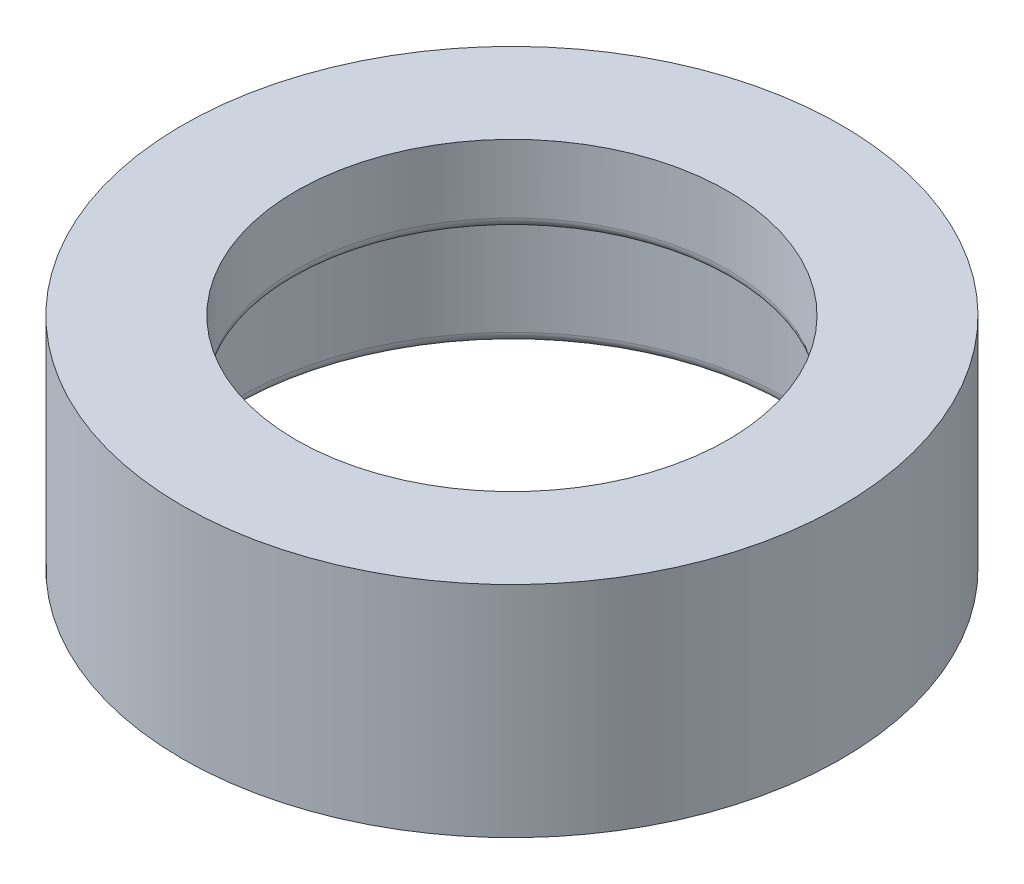
ISO-10303-21;
HEADER;
FILE_DESCRIPTION(('STEP AP214'),'2;1');
FILE_NAME('part.step','',(''),(''),'','','');
FILE_SCHEMA(('AUTOMOTIVE_DESIGN { 1 0 10303 214 1 1 1 1 }'));
ENDSEC;
DATA;
#1=APPLICATION_CONTEXT('core data for automotive mechanical design processes');
#2=APPLICATION_PROTOCOL_DEFINITION('international standard','automotive_design',2000,#1);
#3=PRODUCT_CONTEXT('',#1,'mechanical');
#4=PRODUCT('Part','Part','',(#3));
#5=PRODUCT_RELATED_PRODUCT_CATEGORY('part','',(#4));
#6=PRODUCT_DEFINITION_FORMATION('','',#4);
#7=PRODUCT_DEFINITION_CONTEXT('part definition',#1,'design');
#8=PRODUCT_DEFINITION('design','',#6,#7);
#9=PRODUCT_DEFINITION_SHAPE('','',#8);
#10=(LENGTH_UNIT() NAMED_UNIT(*) SI_UNIT(.MILLI.,.METRE.));
#11=(NAMED_UNIT(*) PLANE_ANGLE_UNIT() SI_UNIT($,.RADIAN.));
#12=(NAMED_UNIT(*) SI_UNIT($,.STERADIAN.) SOLID_ANGLE_UNIT());
#13=UNCERTAINTY_MEASURE_WITH_UNIT(LENGTH_MEASURE(1.E-05),#10,'distance_accuracy_value','');
#14=(GEOMETRIC_REPRESENTATION_CONTEXT(3) GLOBAL_UNCERTAINTY_ASSIGNED_CONTEXT((#13)) GLOBAL_UNIT_ASSIGNED_CONTEXT((#10,
#11,#12)) REPRESENTATION_CONTEXT('',''));
#15=CARTESIAN_POINT('',(0.,0.,0.));
#16=DIRECTION('',(0.,0.,1.));
#17=DIRECTION('',(1.,0.,0.));
#18=AXIS2_PLACEMENT_3D('',#15,#16,#17);
#19=CARTESIAN_POINT('',(0.,20.32,0.));
#20=DIRECTION('',(0.,-1.,0.));
#21=DIRECTION('',(0.,0.,-1.));
#22=AXIS2_PLACEMENT_3D('',#19,#20,#21);
#23=CYLINDRICAL_SURFACE('',#22,30.55);
#24=CARTESIAN_POINT('',(0.,20.32,0.));
#25=DIRECTION('',(0.,1.,0.));
#26=DIRECTION('',(0.,0.,1.));
#27=AXIS2_PLACEMENT_3D('',#24,#25,#26);
#28=CIRCLE('',#27,30.55);
#29=CARTESIAN_POINT('',(0.,20.32,30.55));
#30=VERTEX_POINT('',#29);
#31=EDGE_CURVE('E61',#30,#30,#28,.T.);
#32=ORIENTED_EDGE('',*,*,#31,.F.);
#33=EDGE_LOOP('',(#32));
#34=FACE_BOUND('',#33,.T.);
#35=CARTESIAN_POINT('',(0.,0.,0.));
#36=DIRECTION('',(0.,1.,0.));
#37=DIRECTION('',(0.,0.,1.));
#38=AXIS2_PLACEMENT_3D('',#35,#36,#37);
#39=CIRCLE('',#38,30.55);
#40=CARTESIAN_POINT('',(0.,0.,30.55));
#41=VERTEX_POINT('',#40);
#42=EDGE_CURVE('E62',#41,#41,#39,.T.);
#43=ORIENTED_EDGE('',*,*,#42,.T.);
#44=EDGE_LOOP('',(#43));
#45=FACE_BOUND('',#44,.T.);
#46=ADVANCED_FACE('F37',(#34,#45),#23,.T.);
#47=CARTESIAN_POINT('',(0.,20.32,0.));
#48=DIRECTION('',(0.,1.,0.));
#49=DIRECTION('',(0.,0.,1.));
#50=AXIS2_PLACEMENT_3D('',#47,#48,#49);
#51=PLANE('',#50);
#52=CARTESIAN_POINT('',(0.,20.32,0.));
#53=DIRECTION('',(0.,1.,0.));
#54=DIRECTION('',(0.,0.,1.));
#55=AXIS2_PLACEMENT_3D('',#52,#53,#54);
#56=CIRCLE('',#55,20.);
#57=CARTESIAN_POINT('',(0.,20.32,20.));
#58=VERTEX_POINT('',#57);
#59=EDGE_CURVE('E73',#58,#58,#56,.T.);
#60=ORIENTED_EDGE('',*,*,#59,.F.);
#61=EDGE_LOOP('',(#60));
#62=FACE_BOUND('',#61,.T.);
#63=ORIENTED_EDGE('',*,*,#31,.T.);
#64=EDGE_LOOP('',(#63));
#65=FACE_BOUND('',#64,.T.);
#66=ADVANCED_FACE('F80',(#62,#65),#51,.T.);
#67=CARTESIAN_POINT('',(0.,0.,0.));
#68=DIRECTION('',(0.,1.,0.));
#69=DIRECTION('',(0.,0.,1.));
#70=AXIS2_PLACEMENT_3D('',#67,#68,#69);
#71=PLANE('',#70);
#72=CARTESIAN_POINT('',(0.,0.,0.));
#73=DIRECTION('',(0.,1.,0.));
#74=DIRECTION('',(0.,0.,1.));
#75=AXIS2_PLACEMENT_3D('',#72,#73,#74);
#76=CIRCLE('',#75,26.404);
#77=CARTESIAN_POINT('',(0.,0.,26.404));
#78=VERTEX_POINT('',#77);
#79=EDGE_CURVE('E50',#78,#78,#76,.T.);
#80=ORIENTED_EDGE('',*,*,#79,.T.);
#81=EDGE_LOOP('',(#80));
#82=FACE_BOUND('',#81,.T.);
#83=ORIENTED_EDGE('',*,*,#42,.F.);
#84=EDGE_LOOP('',(#83));
#85=FACE_BOUND('',#84,.T.);
#86=ADVANCED_FACE('F83',(#82,#85),#71,.F.);
#87=CARTESIAN_POINT('',(0.,13.,0.));
#88=DIRECTION('',(0.,-1.,0.));
#89=DIRECTION('',(0.,0.,-1.));
#90=AXIS2_PLACEMENT_3D('',#87,#88,#89);
#91=CYLINDRICAL_SURFACE('',#90,25.404);
#92=CARTESIAN_POINT('',(0.,0.999999999999999,0.));
#93=DIRECTION('',(0.,1.,0.));
#94=DIRECTION('',(0.,0.,1.));
#95=AXIS2_PLACEMENT_3D('',#92,#93,#94);
#96=CIRCLE('',#95,25.404);
#97=CARTESIAN_POINT('',(0.,0.999999999999999,25.404));
#98=VERTEX_POINT('',#97);
#99=EDGE_CURVE('E55',#98,#98,#96,.F.);
#100=ORIENTED_EDGE('',*,*,#99,.T.);
#101=EDGE_LOOP('',(#100));
#102=FACE_BOUND('',#101,.T.);
#103=CARTESIAN_POINT('',(0.,13.,0.));
#104=DIRECTION('',(0.,-1.,0.));
#105=DIRECTION('',(0.,0.,-1.));
#106=AXIS2_PLACEMENT_3D('',#103,#104,#105);
#107=CIRCLE('',#106,25.404);
#108=CARTESIAN_POINT('',(0.,13.,-25.404));
#109=VERTEX_POINT('',#108);
#110=EDGE_CURVE('E66',#109,#109,#107,.T.);
#111=ORIENTED_EDGE('',*,*,#110,.F.);
#112=EDGE_LOOP('',(#111));
#113=FACE_BOUND('',#112,.T.);
#114=ADVANCED_FACE('F93',(#102,#113),#91,.F.);
#115=CARTESIAN_POINT('',(0.,13.,0.));
#116=DIRECTION('',(0.,-1.,0.));
#117=DIRECTION('',(0.,0.,-1.));
#118=AXIS2_PLACEMENT_3D('',#115,#116,#117);
#119=PLANE('',#118);
#120=CARTESIAN_POINT('',(0.,13.,0.));
#121=DIRECTION('',(0.,-1.,0.));
#122=DIRECTION('',(0.,0.,-1.));
#123=AXIS2_PLACEMENT_3D('',#120,#121,#122);
#124=CIRCLE('',#123,21.);
#125=CARTESIAN_POINT('',(0.,13.,-21.));
#126=VERTEX_POINT('',#125);
#127=EDGE_CURVE('E10',#126,#126,#124,.F.);
#128=ORIENTED_EDGE('',*,*,#127,.T.);
#129=EDGE_LOOP('',(#128));
#130=FACE_BOUND('',#129,.T.);
#131=ORIENTED_EDGE('',*,*,#110,.T.);
#132=EDGE_LOOP('',(#131));
#133=FACE_BOUND('',#132,.T.);
#134=ADVANCED_FACE('F99',(#130,#133),#119,.T.);
#135=CARTESIAN_POINT('',(0.,0.,0.));
#136=DIRECTION('',(0.,1.,0.));
#137=DIRECTION('',(0.,0.,1.));
#138=AXIS2_PLACEMENT_3D('',#135,#136,#137);
#139=CYLINDRICAL_SURFACE('',#138,20.);
#140=CARTESIAN_POINT('',(0.,14.,0.));
#141=DIRECTION('',(0.,-1.,0.));
#142=DIRECTION('',(0.,0.,-1.));
#143=AXIS2_PLACEMENT_3D('',#140,#141,#142);
#144=CIRCLE('',#143,20.);
#145=CARTESIAN_POINT('',(0.,14.,-20.));
#146=VERTEX_POINT('',#145);
#147=EDGE_CURVE('E45',#146,#146,#144,.T.);
#148=ORIENTED_EDGE('',*,*,#147,.T.);
#149=EDGE_LOOP('',(#148));
#150=FACE_BOUND('',#149,.T.);
#151=ORIENTED_EDGE('',*,*,#59,.T.);
#152=EDGE_LOOP('',(#151));
#153=FACE_BOUND('',#152,.T.);
#154=ADVANCED_FACE('F78',(#150,#153),#139,.F.);
#155=CARTESIAN_POINT('',(0.,0.999999999999999,0.));
#156=DIRECTION('',(0.,1.,0.));
#157=DIRECTION('',(0.,0.,1.));
#158=AXIS2_PLACEMENT_3D('',#155,#156,#157);
#159=TOROIDAL_SURFACE('',#158,26.404,1.);
#160=ORIENTED_EDGE('',*,*,#79,.F.);
#161=EDGE_LOOP('',(#160));
#162=FACE_BOUND('',#161,.T.);
#163=ORIENTED_EDGE('',*,*,#99,.F.);
#164=EDGE_LOOP('',(#163));
#165=FACE_BOUND('',#164,.T.);
#166=ADVANCED_FACE('F102',(#162,#165),#159,.T.);
#167=CARTESIAN_POINT('',(0.,14.,0.));
#168=DIRECTION('',(0.,-1.,0.));
#169=DIRECTION('',(0.,0.,-1.));
#170=AXIS2_PLACEMENT_3D('',#167,#168,#169);
#171=TOROIDAL_SURFACE('',#170,21.,1.);
#172=ORIENTED_EDGE('',*,*,#127,.F.);
#173=EDGE_LOOP('',(#172));
#174=FACE_BOUND('',#173,.T.);
#175=ORIENTED_EDGE('',*,*,#147,.F.);
#176=EDGE_LOOP('',(#175));
#177=FACE_BOUND('',#176,.T.);
#178=ADVANCED_FACE('F39',(#174,#177),#171,.T.);
#179=CLOSED_SHELL('',(#46,#66,#86,#114,#134,#154,#166,#178));
#180=MANIFOLD_SOLID_BREP('B2',#179);
#181=ADVANCED_BREP_SHAPE_REPRESENTATION('',(#18,#180),#14);
#182=SHAPE_DEFINITION_REPRESENTATION(#9,#181);
ENDSEC;
END-ISO-10303-21;
